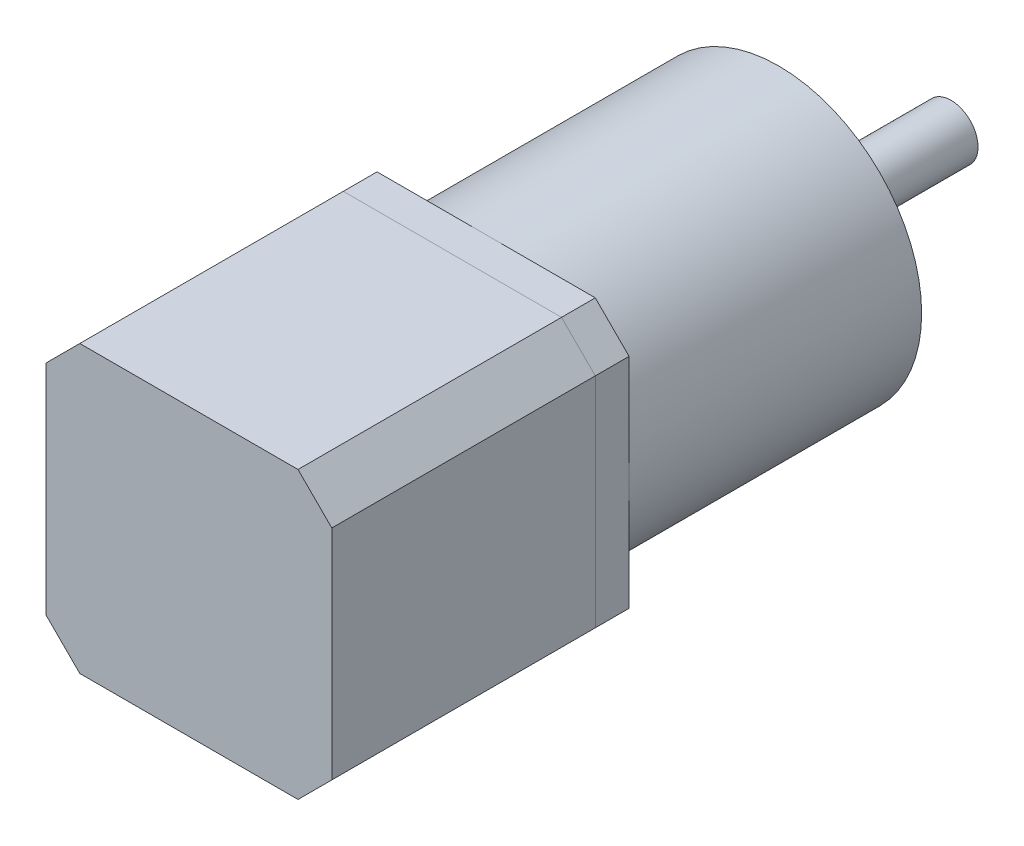
ISO-10303-21;
HEADER;
FILE_DESCRIPTION(('STEP AP214'),'2;1');
FILE_NAME('part.step','',(''),(''),'','','');
FILE_SCHEMA(('AUTOMOTIVE_DESIGN { 1 0 10303 214 1 1 1 1 }'));
ENDSEC;
DATA;
#1=APPLICATION_CONTEXT('core data for automotive mechanical design processes');
#2=APPLICATION_PROTOCOL_DEFINITION('international standard','automotive_design',2000,#1);
#3=PRODUCT_CONTEXT('',#1,'mechanical');
#4=PRODUCT('Part','Part','',(#3));
#5=PRODUCT_RELATED_PRODUCT_CATEGORY('part','',(#4));
#6=PRODUCT_DEFINITION_FORMATION('','',#4);
#7=PRODUCT_DEFINITION_CONTEXT('part definition',#1,'design');
#8=PRODUCT_DEFINITION('design','',#6,#7);
#9=PRODUCT_DEFINITION_SHAPE('','',#8);
#10=(LENGTH_UNIT() NAMED_UNIT(*) SI_UNIT(.MILLI.,.METRE.));
#11=(NAMED_UNIT(*) PLANE_ANGLE_UNIT() SI_UNIT($,.RADIAN.));
#12=(NAMED_UNIT(*) SI_UNIT($,.STERADIAN.) SOLID_ANGLE_UNIT());
#13=UNCERTAINTY_MEASURE_WITH_UNIT(LENGTH_MEASURE(1.E-05),#10,'distance_accuracy_value','');
#14=(GEOMETRIC_REPRESENTATION_CONTEXT(3) GLOBAL_UNCERTAINTY_ASSIGNED_CONTEXT((#13)) GLOBAL_UNIT_ASSIGNED_CONTEXT((#10,
#11,#12)) REPRESENTATION_CONTEXT('',''));
#15=CARTESIAN_POINT('',(0.,0.,0.));
#16=DIRECTION('',(0.,0.,1.));
#17=DIRECTION('',(1.,0.,0.));
#18=AXIS2_PLACEMENT_3D('',#15,#16,#17);
#19=CARTESIAN_POINT('',(0.,0.,-50.8));
#20=DIRECTION('',(0.,0.,1.));
#21=DIRECTION('',(1.,0.,0.));
#22=AXIS2_PLACEMENT_3D('',#19,#20,#21);
#23=CYLINDRICAL_SURFACE('',#22,6.21097509165244);
#24=CARTESIAN_POINT('',(0.,0.,-50.8));
#25=DIRECTION('',(0.,0.,-1.));
#26=DIRECTION('',(-1.,0.,0.));
#27=AXIS2_PLACEMENT_3D('',#24,#25,#26);
#28=CIRCLE('',#27,6.21097509165244);
#29=CARTESIAN_POINT('',(-6.21097509165244,0.,-50.8));
#30=VERTEX_POINT('',#29);
#31=EDGE_CURVE('E11',#30,#30,#28,.T.);
#32=ORIENTED_EDGE('',*,*,#31,.F.);
#33=EDGE_LOOP('',(#32));
#34=FACE_BOUND('',#33,.T.);
#35=CARTESIAN_POINT('',(0.,0.,-50.3));
#36=DIRECTION('',(0.,0.,-1.));
#37=DIRECTION('',(-1.,0.,0.));
#38=AXIS2_PLACEMENT_3D('',#35,#36,#37);
#39=CIRCLE('',#38,6.21097509165244);
#40=CARTESIAN_POINT('',(-6.21097509165244,0.,-50.3));
#41=VERTEX_POINT('',#40);
#42=EDGE_CURVE('E44',#41,#41,#39,.T.);
#43=ORIENTED_EDGE('',*,*,#42,.T.);
#44=EDGE_LOOP('',(#43));
#45=FACE_BOUND('',#44,.T.);
#46=ADVANCED_FACE('F41',(#34,#45),#23,.T.);
#47=CARTESIAN_POINT('',(0.,0.,-50.8));
#48=DIRECTION('',(0.,0.,-1.));
#49=DIRECTION('',(-1.,0.,0.));
#50=AXIS2_PLACEMENT_3D('',#47,#48,#49);
#51=PLANE('',#50);
#52=ORIENTED_EDGE('',*,*,#31,.T.);
#53=EDGE_LOOP('',(#52));
#54=FACE_BOUND('',#53,.T.);
#55=ADVANCED_FACE('F56',(#54),#51,.T.);
#56=CARTESIAN_POINT('',(0.,0.,-50.3));
#57=DIRECTION('',(0.,0.,-1.));
#58=DIRECTION('',(-1.,0.,0.));
#59=AXIS2_PLACEMENT_3D('',#56,#57,#58);
#60=PLANE('',#59);
#61=ORIENTED_EDGE('',*,*,#42,.F.);
#62=EDGE_LOOP('',(#61));
#63=FACE_BOUND('',#62,.T.);
#64=ADVANCED_FACE('F54',(#63),#60,.F.);
#65=CLOSED_SHELL('',(#46,#55,#64));
#66=MANIFOLD_SOLID_BREP('B2',#65);
#67=CARTESIAN_POINT('',(0.,0.,-73.8));
#68=DIRECTION('',(0.,0.,1.));
#69=DIRECTION('',(1.,0.,0.));
#70=AXIS2_PLACEMENT_3D('',#67,#68,#69);
#71=CYLINDRICAL_SURFACE('',#70,4.);
#72=CARTESIAN_POINT('',(0.,0.,-73.8));
#73=DIRECTION('',(0.,0.,-1.));
#74=DIRECTION('',(-1.,0.,0.));
#75=AXIS2_PLACEMENT_3D('',#72,#73,#74);
#76=CIRCLE('',#75,4.);
#77=CARTESIAN_POINT('',(-4.,0.,-73.8));
#78=VERTEX_POINT('',#77);
#79=EDGE_CURVE('E40',#78,#78,#76,.T.);
#80=ORIENTED_EDGE('',*,*,#79,.F.);
#81=EDGE_LOOP('',(#80));
#82=FACE_BOUND('',#81,.T.);
#83=CARTESIAN_POINT('',(0.,0.,-50.3));
#84=DIRECTION('',(0.,0.,-1.));
#85=DIRECTION('',(-1.,0.,0.));
#86=AXIS2_PLACEMENT_3D('',#83,#84,#85);
#87=CIRCLE('',#86,4.);
#88=CARTESIAN_POINT('',(-4.,0.,-50.3));
#89=VERTEX_POINT('',#88);
#90=EDGE_CURVE('E92',#89,#89,#87,.T.);
#91=ORIENTED_EDGE('',*,*,#90,.T.);
#92=EDGE_LOOP('',(#91));
#93=FACE_BOUND('',#92,.T.);
#94=ADVANCED_FACE('F89',(#82,#93),#71,.T.);
#95=CARTESIAN_POINT('',(0.,0.,-73.8));
#96=DIRECTION('',(0.,0.,-1.));
#97=DIRECTION('',(-1.,0.,0.));
#98=AXIS2_PLACEMENT_3D('',#95,#96,#97);
#99=PLANE('',#98);
#100=ORIENTED_EDGE('',*,*,#79,.T.);
#101=EDGE_LOOP('',(#100));
#102=FACE_BOUND('',#101,.T.);
#103=ADVANCED_FACE('F104',(#102),#99,.T.);
#104=CARTESIAN_POINT('',(0.,0.,-50.3));
#105=DIRECTION('',(0.,0.,-1.));
#106=DIRECTION('',(-1.,0.,0.));
#107=AXIS2_PLACEMENT_3D('',#104,#105,#106);
#108=PLANE('',#107);
#109=ORIENTED_EDGE('',*,*,#90,.F.);
#110=EDGE_LOOP('',(#109));
#111=FACE_BOUND('',#110,.T.);
#112=ADVANCED_FACE('F102',(#111),#108,.F.);
#113=CLOSED_SHELL('',(#94,#103,#112));
#114=MANIFOLD_SOLID_BREP('B6',#113);
#115=CARTESIAN_POINT('',(0.,0.,-50.3));
#116=DIRECTION('',(0.,0.,1.));
#117=DIRECTION('',(1.,0.,0.));
#118=AXIS2_PLACEMENT_3D('',#115,#116,#117);
#119=CYLINDRICAL_SURFACE('',#118,11.);
#120=CARTESIAN_POINT('',(0.,0.,-50.3));
#121=DIRECTION('',(0.,0.,-1.));
#122=DIRECTION('',(-1.,0.,0.));
#123=AXIS2_PLACEMENT_3D('',#120,#121,#122);
#124=CIRCLE('',#123,11.);
#125=CARTESIAN_POINT('',(-11.,0.,-50.3));
#126=VERTEX_POINT('',#125);
#127=EDGE_CURVE('E88',#126,#126,#124,.T.);
#128=ORIENTED_EDGE('',*,*,#127,.F.);
#129=EDGE_LOOP('',(#128));
#130=FACE_BOUND('',#129,.T.);
#131=CARTESIAN_POINT('',(0.,0.,-48.3));
#132=DIRECTION('',(0.,0.,-1.));
#133=DIRECTION('',(-1.,0.,0.));
#134=AXIS2_PLACEMENT_3D('',#131,#132,#133);
#135=CIRCLE('',#134,11.);
#136=CARTESIAN_POINT('',(-11.,0.,-48.3));
#137=VERTEX_POINT('',#136);
#138=EDGE_CURVE('E140',#137,#137,#135,.T.);
#139=ORIENTED_EDGE('',*,*,#138,.T.);
#140=EDGE_LOOP('',(#139));
#141=FACE_BOUND('',#140,.T.);
#142=ADVANCED_FACE('F137',(#130,#141),#119,.T.);
#143=CARTESIAN_POINT('',(0.,0.,-50.3));
#144=DIRECTION('',(0.,0.,-1.));
#145=DIRECTION('',(-1.,0.,0.));
#146=AXIS2_PLACEMENT_3D('',#143,#144,#145);
#147=PLANE('',#146);
#148=ORIENTED_EDGE('',*,*,#127,.T.);
#149=EDGE_LOOP('',(#148));
#150=FACE_BOUND('',#149,.T.);
#151=ADVANCED_FACE('F152',(#150),#147,.T.);
#152=CARTESIAN_POINT('',(0.,0.,-48.3));
#153=DIRECTION('',(0.,0.,-1.));
#154=DIRECTION('',(-1.,0.,0.));
#155=AXIS2_PLACEMENT_3D('',#152,#153,#154);
#156=PLANE('',#155);
#157=ORIENTED_EDGE('',*,*,#138,.F.);
#158=EDGE_LOOP('',(#157));
#159=FACE_BOUND('',#158,.T.);
#160=ADVANCED_FACE('F150',(#159),#156,.F.);
#161=CLOSED_SHELL('',(#142,#151,#160));
#162=MANIFOLD_SOLID_BREP('B35',#161);
#163=CARTESIAN_POINT('',(0.,0.,-48.3));
#164=DIRECTION('',(0.,0.,1.));
#165=DIRECTION('',(1.,0.,0.));
#166=AXIS2_PLACEMENT_3D('',#163,#164,#165);
#167=CYLINDRICAL_SURFACE('',#166,21.15);
#168=CARTESIAN_POINT('',(0.,0.,-48.3));
#169=DIRECTION('',(0.,0.,-1.));
#170=DIRECTION('',(-1.,0.,0.));
#171=AXIS2_PLACEMENT_3D('',#168,#169,#170);
#172=CIRCLE('',#171,21.15);
#173=CARTESIAN_POINT('',(-21.15,0.,-48.3));
#174=VERTEX_POINT('',#173);
#175=EDGE_CURVE('E136',#174,#174,#172,.T.);
#176=ORIENTED_EDGE('',*,*,#175,.F.);
#177=EDGE_LOOP('',(#176));
#178=FACE_BOUND('',#177,.T.);
#179=CARTESIAN_POINT('',(0.,0.,-5.));
#180=DIRECTION('',(0.,0.,-1.));
#181=DIRECTION('',(-1.,0.,0.));
#182=AXIS2_PLACEMENT_3D('',#179,#180,#181);
#183=CIRCLE('',#182,21.15);
#184=CARTESIAN_POINT('',(-21.15,0.,-5.));
#185=VERTEX_POINT('',#184);
#186=EDGE_CURVE('E190',#185,#185,#183,.T.);
#187=ORIENTED_EDGE('',*,*,#186,.T.);
#188=EDGE_LOOP('',(#187));
#189=FACE_BOUND('',#188,.T.);
#190=ADVANCED_FACE('F187',(#178,#189),#167,.T.);
#191=CARTESIAN_POINT('',(0.,0.,-48.3));
#192=DIRECTION('',(0.,0.,-1.));
#193=DIRECTION('',(-1.,0.,0.));
#194=AXIS2_PLACEMENT_3D('',#191,#192,#193);
#195=PLANE('',#194);
#196=CARTESIAN_POINT('',(-17.5000000000005,4.95236783133562E-13,-48.3));
#197=DIRECTION('',(0.,0.,-1.));
#198=DIRECTION('',(-1.,0.,0.));
#199=AXIS2_PLACEMENT_3D('',#196,#197,#198);
#200=CIRCLE('',#199,1.14415066271215);
#201=CARTESIAN_POINT('',(-18.6441506627126,4.95236783133562E-13,-48.3));
#202=VERTEX_POINT('',#201);
#203=EDGE_CURVE('E217',#202,#202,#200,.T.);
#204=ORIENTED_EDGE('',*,*,#203,.F.);
#205=EDGE_LOOP('',(#204));
#206=FACE_BOUND('',#205,.T.);
#207=CARTESIAN_POINT('',(-9.90473566267125E-13,-17.5,-48.3));
#208=DIRECTION('',(0.,0.,-1.));
#209=DIRECTION('',(-1.,0.,0.));
#210=AXIS2_PLACEMENT_3D('',#207,#208,#209);
#211=CIRCLE('',#210,1.14415066271282);
#212=CARTESIAN_POINT('',(-1.14415066271381,-17.5,-48.3));
#213=VERTEX_POINT('',#212);
#214=EDGE_CURVE('E211',#213,#213,#211,.T.);
#215=ORIENTED_EDGE('',*,*,#214,.F.);
#216=EDGE_LOOP('',(#215));
#217=FACE_BOUND('',#216,.T.);
#218=CARTESIAN_POINT('',(17.4999999999995,-4.9737991503207E-13,-48.3));
#219=DIRECTION('',(0.,0.,-1.));
#220=DIRECTION('',(-1.,0.,0.));
#221=AXIS2_PLACEMENT_3D('',#218,#219,#220);
#222=CIRCLE('',#221,1.14415066271255);
#223=CARTESIAN_POINT('',(16.355849337287,-4.9737991503207E-13,-48.3));
#224=VERTEX_POINT('',#223);
#225=EDGE_CURVE('E205',#224,#224,#222,.T.);
#226=ORIENTED_EDGE('',*,*,#225,.F.);
#227=EDGE_LOOP('',(#226));
#228=FACE_BOUND('',#227,.T.);
#229=CARTESIAN_POINT('',(0.,17.5,-48.3));
#230=DIRECTION('',(0.,0.,-1.));
#231=DIRECTION('',(-1.,0.,0.));
#232=AXIS2_PLACEMENT_3D('',#229,#230,#231);
#233=CIRCLE('',#232,1.14415066271176);
#234=CARTESIAN_POINT('',(-1.14415066271176,17.5,-48.3));
#235=VERTEX_POINT('',#234);
#236=EDGE_CURVE('E199',#235,#235,#233,.T.);
#237=ORIENTED_EDGE('',*,*,#236,.F.);
#238=EDGE_LOOP('',(#237));
#239=FACE_BOUND('',#238,.T.);
#240=ORIENTED_EDGE('',*,*,#175,.T.);
#241=EDGE_LOOP('',(#240));
#242=FACE_BOUND('',#241,.T.);
#243=ADVANCED_FACE('F232',(#206,#217,#228,#239,#242),#195,.T.);
#244=CARTESIAN_POINT('',(0.,0.,-5.));
#245=DIRECTION('',(0.,0.,-1.));
#246=DIRECTION('',(-1.,0.,0.));
#247=AXIS2_PLACEMENT_3D('',#244,#245,#246);
#248=PLANE('',#247);
#249=ORIENTED_EDGE('',*,*,#186,.F.);
#250=EDGE_LOOP('',(#249));
#251=FACE_BOUND('',#250,.T.);
#252=ADVANCED_FACE('F235',(#251),#248,.F.);
#253=CARTESIAN_POINT('',(0.,17.5,-38.3));
#254=DIRECTION('',(0.,0.,-1.));
#255=DIRECTION('',(-1.,0.,0.));
#256=AXIS2_PLACEMENT_3D('',#253,#254,#255);
#257=CYLINDRICAL_SURFACE('',#256,1.14415066271176);
#258=CARTESIAN_POINT('',(0.,17.5,-38.3));
#259=DIRECTION('',(0.,0.,-1.));
#260=DIRECTION('',(-1.,0.,0.));
#261=AXIS2_PLACEMENT_3D('',#258,#259,#260);
#262=CIRCLE('',#261,1.14415066271176);
#263=CARTESIAN_POINT('',(-1.14415066271176,17.5,-38.3));
#264=VERTEX_POINT('',#263);
#265=EDGE_CURVE('E197',#264,#264,#262,.T.);
#266=ORIENTED_EDGE('',*,*,#265,.F.);
#267=EDGE_LOOP('',(#266));
#268=FACE_BOUND('',#267,.T.);
#269=ORIENTED_EDGE('',*,*,#236,.T.);
#270=EDGE_LOOP('',(#269));
#271=FACE_BOUND('',#270,.T.);
#272=ADVANCED_FACE('F243',(#268,#271),#257,.F.);
#273=CARTESIAN_POINT('',(0.,17.5,-38.3));
#274=DIRECTION('',(0.,0.,-1.));
#275=DIRECTION('',(-1.,0.,0.));
#276=AXIS2_PLACEMENT_3D('',#273,#274,#275);
#277=PLANE('',#276);
#278=ORIENTED_EDGE('',*,*,#265,.T.);
#279=EDGE_LOOP('',(#278));
#280=FACE_BOUND('',#279,.T.);
#281=ADVANCED_FACE('F245',(#280),#277,.T.);
#282=CARTESIAN_POINT('',(17.4999999999995,-4.9737991503207E-13,-38.3));
#283=DIRECTION('',(0.,0.,-1.));
#284=DIRECTION('',(-1.,0.,0.));
#285=AXIS2_PLACEMENT_3D('',#282,#283,#284);
#286=CYLINDRICAL_SURFACE('',#285,1.14415066271255);
#287=CARTESIAN_POINT('',(17.4999999999995,-4.9737991503207E-13,-38.3));
#288=DIRECTION('',(0.,0.,-1.));
#289=DIRECTION('',(-1.,0.,0.));
#290=AXIS2_PLACEMENT_3D('',#287,#288,#289);
#291=CIRCLE('',#290,1.14415066271255);
#292=CARTESIAN_POINT('',(16.355849337287,-4.9737991503207E-13,-38.3));
#293=VERTEX_POINT('',#292);
#294=EDGE_CURVE('E208',#293,#293,#291,.T.);
#295=ORIENTED_EDGE('',*,*,#294,.F.);
#296=EDGE_LOOP('',(#295));
#297=FACE_BOUND('',#296,.T.);
#298=ORIENTED_EDGE('',*,*,#225,.T.);
#299=EDGE_LOOP('',(#298));
#300=FACE_BOUND('',#299,.T.);
#301=ADVANCED_FACE('F252',(#297,#300),#286,.F.);
#302=CARTESIAN_POINT('',(17.4999999999995,-4.9737991503207E-13,-38.3));
#303=DIRECTION('',(0.,0.,-1.));
#304=DIRECTION('',(-1.,0.,0.));
#305=AXIS2_PLACEMENT_3D('',#302,#303,#304);
#306=PLANE('',#305);
#307=ORIENTED_EDGE('',*,*,#294,.T.);
#308=EDGE_LOOP('',(#307));
#309=FACE_BOUND('',#308,.T.);
#310=ADVANCED_FACE('F292',(#309),#306,.T.);
#311=CARTESIAN_POINT('',(-9.90473566267125E-13,-17.5,-38.3));
#312=DIRECTION('',(0.,0.,-1.));
#313=DIRECTION('',(-1.,0.,0.));
#314=AXIS2_PLACEMENT_3D('',#311,#312,#313);
#315=CYLINDRICAL_SURFACE('',#314,1.14415066271282);
#316=CARTESIAN_POINT('',(-9.90473566267125E-13,-17.5,-38.3));
#317=DIRECTION('',(0.,0.,-1.));
#318=DIRECTION('',(-1.,0.,0.));
#319=AXIS2_PLACEMENT_3D('',#316,#317,#318);
#320=CIRCLE('',#319,1.14415066271282);
#321=CARTESIAN_POINT('',(-1.14415066271381,-17.5,-38.3));
#322=VERTEX_POINT('',#321);
#323=EDGE_CURVE('E214',#322,#322,#320,.T.);
#324=ORIENTED_EDGE('',*,*,#323,.F.);
#325=EDGE_LOOP('',(#324));
#326=FACE_BOUND('',#325,.T.);
#327=ORIENTED_EDGE('',*,*,#214,.T.);
#328=EDGE_LOOP('',(#327));
#329=FACE_BOUND('',#328,.T.);
#330=ADVANCED_FACE('F301',(#326,#329),#315,.F.);
#331=CARTESIAN_POINT('',(-9.90473566267125E-13,-17.5,-38.3));
#332=DIRECTION('',(0.,0.,-1.));
#333=DIRECTION('',(-1.,0.,0.));
#334=AXIS2_PLACEMENT_3D('',#331,#332,#333);
#335=PLANE('',#334);
#336=ORIENTED_EDGE('',*,*,#323,.T.);
#337=EDGE_LOOP('',(#336));
#338=FACE_BOUND('',#337,.T.);
#339=ADVANCED_FACE('F228',(#338),#335,.T.);
#340=CARTESIAN_POINT('',(-17.5000000000005,4.95236783133562E-13,-38.3));
#341=DIRECTION('',(0.,0.,-1.));
#342=DIRECTION('',(-1.,0.,0.));
#343=AXIS2_PLACEMENT_3D('',#340,#341,#342);
#344=CYLINDRICAL_SURFACE('',#343,1.14415066271215);
#345=CARTESIAN_POINT('',(-17.5000000000005,4.95236783133562E-13,-38.3));
#346=DIRECTION('',(0.,0.,-1.));
#347=DIRECTION('',(-1.,0.,0.));
#348=AXIS2_PLACEMENT_3D('',#345,#346,#347);
#349=CIRCLE('',#348,1.14415066271215);
#350=CARTESIAN_POINT('',(-18.6441506627126,4.95236783133562E-13,-38.3));
#351=VERTEX_POINT('',#350);
#352=EDGE_CURVE('E202',#351,#351,#349,.T.);
#353=ORIENTED_EDGE('',*,*,#352,.F.);
#354=EDGE_LOOP('',(#353));
#355=FACE_BOUND('',#354,.T.);
#356=ORIENTED_EDGE('',*,*,#203,.T.);
#357=EDGE_LOOP('',(#356));
#358=FACE_BOUND('',#357,.T.);
#359=ADVANCED_FACE('F225',(#355,#358),#344,.F.);
#360=CARTESIAN_POINT('',(-17.5000000000005,4.95236783133562E-13,-38.3));
#361=DIRECTION('',(0.,0.,-1.));
#362=DIRECTION('',(-1.,0.,0.));
#363=AXIS2_PLACEMENT_3D('',#360,#361,#362);
#364=PLANE('',#363);
#365=ORIENTED_EDGE('',*,*,#352,.T.);
#366=EDGE_LOOP('',(#365));
#367=FACE_BOUND('',#366,.T.);
#368=ADVANCED_FACE('F223',(#367),#364,.T.);
#369=CLOSED_SHELL('',(#190,#243,#252,#272,#281,#301,#310,#330,#339,#359,#368));
#370=MANIFOLD_SOLID_BREP('B83',#369);
#371=CARTESIAN_POINT('',(-21.15,-21.15,-5.));
#372=DIRECTION('',(1.,0.,0.));
#373=DIRECTION('',(0.,0.,-1.));
#374=AXIS2_PLACEMENT_3D('',#371,#372,#373);
#375=PLANE('',#374);
#376=DIRECTION('',(0.,1.,0.));
#377=VECTOR('',#376,1.);
#378=CARTESIAN_POINT('',(-21.15,-21.15,-5.));
#379=LINE('',#378,#377);
#380=CARTESIAN_POINT('',(-21.15,-16.15,-5.));
#381=VERTEX_POINT('',#380);
#382=CARTESIAN_POINT('',(-21.15,16.15,-5.));
#383=VERTEX_POINT('',#382);
#384=EDGE_CURVE('E447',#381,#383,#379,.T.);
#385=ORIENTED_EDGE('',*,*,#384,.F.);
#386=DIRECTION('',(0.,0.,1.));
#387=VECTOR('',#386,1.);
#388=CARTESIAN_POINT('',(-21.15,-16.15,-5.));
#389=LINE('',#388,#387);
#390=CARTESIAN_POINT('',(-21.15,-16.15,0.));
#391=VERTEX_POINT('',#390);
#392=EDGE_CURVE('E473',#381,#391,#389,.T.);
#393=ORIENTED_EDGE('',*,*,#392,.T.);
#394=DIRECTION('',(0.,1.,0.));
#395=VECTOR('',#394,1.);
#396=CARTESIAN_POINT('',(-21.15,-21.15,0.));
#397=LINE('',#396,#395);
#398=CARTESIAN_POINT('',(-21.15,16.15,0.));
#399=VERTEX_POINT('',#398);
#400=EDGE_CURVE('E481',#391,#399,#397,.T.);
#401=ORIENTED_EDGE('',*,*,#400,.T.);
#402=DIRECTION('',(0.,0.,-1.));
#403=VECTOR('',#402,1.);
#404=CARTESIAN_POINT('',(-21.15,16.15,-5.));
#405=LINE('',#404,#403);
#406=EDGE_CURVE('E471',#399,#383,#405,.T.);
#407=ORIENTED_EDGE('',*,*,#406,.T.);
#408=EDGE_LOOP('',(#385,#393,#401,#407));
#409=FACE_BOUND('',#408,.T.);
#410=ADVANCED_FACE('F356',(#409),#375,.F.);
#411=CARTESIAN_POINT('',(21.15,21.15,-5.));
#412=DIRECTION('',(0.,-1.,0.));
#413=DIRECTION('',(0.,0.,-1.));
#414=AXIS2_PLACEMENT_3D('',#411,#412,#413);
#415=PLANE('',#414);
#416=DIRECTION('',(1.,0.,0.));
#417=VECTOR('',#416,1.);
#418=CARTESIAN_POINT('',(21.15,21.15,0.));
#419=LINE('',#418,#417);
#420=CARTESIAN_POINT('',(-16.15,21.15,0.));
#421=VERTEX_POINT('',#420);
#422=CARTESIAN_POINT('',(16.15,21.15,0.));
#423=VERTEX_POINT('',#422);
#424=EDGE_CURVE('E452',#421,#423,#419,.T.);
#425=ORIENTED_EDGE('',*,*,#424,.T.);
#426=DIRECTION('',(0.,0.,-1.));
#427=VECTOR('',#426,1.);
#428=CARTESIAN_POINT('',(16.15,21.15,-5.));
#429=LINE('',#428,#427);
#430=CARTESIAN_POINT('',(16.15,21.15,-5.));
#431=VERTEX_POINT('',#430);
#432=EDGE_CURVE('E185',#423,#431,#429,.T.);
#433=ORIENTED_EDGE('',*,*,#432,.T.);
#434=DIRECTION('',(1.,0.,0.));
#435=VECTOR('',#434,1.);
#436=CARTESIAN_POINT('',(21.15,21.15,-5.));
#437=LINE('',#436,#435);
#438=CARTESIAN_POINT('',(-16.15,21.15,-5.));
#439=VERTEX_POINT('',#438);
#440=EDGE_CURVE('E450',#439,#431,#437,.T.);
#441=ORIENTED_EDGE('',*,*,#440,.F.);
#442=DIRECTION('',(0.,0.,1.));
#443=VECTOR('',#442,1.);
#444=CARTESIAN_POINT('',(-16.15,21.15,-5.));
#445=LINE('',#444,#443);
#446=EDGE_CURVE('E364',#439,#421,#445,.T.);
#447=ORIENTED_EDGE('',*,*,#446,.T.);
#448=EDGE_LOOP('',(#425,#433,#441,#447));
#449=FACE_BOUND('',#448,.T.);
#450=ADVANCED_FACE('F478',(#449),#415,.F.);
#451=CARTESIAN_POINT('',(21.15,-21.15,-5.));
#452=DIRECTION('',(-1.,0.,0.));
#453=DIRECTION('',(0.,0.,1.));
#454=AXIS2_PLACEMENT_3D('',#451,#452,#453);
#455=PLANE('',#454);
#456=DIRECTION('',(0.,-1.,0.));
#457=VECTOR('',#456,1.);
#458=CARTESIAN_POINT('',(21.15,-21.15,0.));
#459=LINE('',#458,#457);
#460=CARTESIAN_POINT('',(21.15,16.15,0.));
#461=VERTEX_POINT('',#460);
#462=CARTESIAN_POINT('',(21.15,-16.15,0.));
#463=VERTEX_POINT('',#462);
#464=EDGE_CURVE('E448',#461,#463,#459,.T.);
#465=ORIENTED_EDGE('',*,*,#464,.T.);
#466=DIRECTION('',(0.,0.,-1.));
#467=VECTOR('',#466,1.);
#468=CARTESIAN_POINT('',(21.15,-16.15,-5.));
#469=LINE('',#468,#467);
#470=CARTESIAN_POINT('',(21.15,-16.15,-5.));
#471=VERTEX_POINT('',#470);
#472=EDGE_CURVE('E426',#463,#471,#469,.T.);
#473=ORIENTED_EDGE('',*,*,#472,.T.);
#474=DIRECTION('',(0.,-1.,0.));
#475=VECTOR('',#474,1.);
#476=CARTESIAN_POINT('',(21.15,-21.15,-5.));
#477=LINE('',#476,#475);
#478=CARTESIAN_POINT('',(21.15,16.15,-5.));
#479=VERTEX_POINT('',#478);
#480=EDGE_CURVE('E485',#479,#471,#477,.T.);
#481=ORIENTED_EDGE('',*,*,#480,.F.);
#482=DIRECTION('',(0.,0.,1.));
#483=VECTOR('',#482,1.);
#484=CARTESIAN_POINT('',(21.15,16.15,-5.));
#485=LINE('',#484,#483);
#486=EDGE_CURVE('E431',#479,#461,#485,.T.);
#487=ORIENTED_EDGE('',*,*,#486,.T.);
#488=EDGE_LOOP('',(#465,#473,#481,#487));
#489=FACE_BOUND('',#488,.T.);
#490=ADVANCED_FACE('F495',(#489),#455,.F.);
#491=CARTESIAN_POINT('',(21.15,-21.15,-5.));
#492=DIRECTION('',(0.,1.,0.));
#493=DIRECTION('',(0.,0.,1.));
#494=AXIS2_PLACEMENT_3D('',#491,#492,#493);
#495=PLANE('',#494);
#496=DIRECTION('',(-1.,0.,0.));
#497=VECTOR('',#496,1.);
#498=CARTESIAN_POINT('',(21.15,-21.15,-5.));
#499=LINE('',#498,#497);
#500=CARTESIAN_POINT('',(16.15,-21.15,-5.));
#501=VERTEX_POINT('',#500);
#502=CARTESIAN_POINT('',(-16.15,-21.15,-5.));
#503=VERTEX_POINT('',#502);
#504=EDGE_CURVE('E441',#501,#503,#499,.T.);
#505=ORIENTED_EDGE('',*,*,#504,.F.);
#506=DIRECTION('',(0.,0.,1.));
#507=VECTOR('',#506,1.);
#508=CARTESIAN_POINT('',(16.15,-21.15,-5.));
#509=LINE('',#508,#507);
#510=CARTESIAN_POINT('',(16.15,-21.15,0.));
#511=VERTEX_POINT('',#510);
#512=EDGE_CURVE('E425',#501,#511,#509,.T.);
#513=ORIENTED_EDGE('',*,*,#512,.T.);
#514=DIRECTION('',(-1.,0.,0.));
#515=VECTOR('',#514,1.);
#516=CARTESIAN_POINT('',(21.15,-21.15,0.));
#517=LINE('',#516,#515);
#518=CARTESIAN_POINT('',(-16.15,-21.15,0.));
#519=VERTEX_POINT('',#518);
#520=EDGE_CURVE('E438',#511,#519,#517,.T.);
#521=ORIENTED_EDGE('',*,*,#520,.T.);
#522=DIRECTION('',(0.,0.,-1.));
#523=VECTOR('',#522,1.);
#524=CARTESIAN_POINT('',(-16.15,-21.15,-5.));
#525=LINE('',#524,#523);
#526=EDGE_CURVE('E443',#519,#503,#525,.T.);
#527=ORIENTED_EDGE('',*,*,#526,.T.);
#528=EDGE_LOOP('',(#505,#513,#521,#527));
#529=FACE_BOUND('',#528,.T.);
#530=ADVANCED_FACE('F437',(#529),#495,.F.);
#531=CARTESIAN_POINT('',(0.,0.,-5.));
#532=DIRECTION('',(0.,0.,1.));
#533=DIRECTION('',(1.,0.,0.));
#534=AXIS2_PLACEMENT_3D('',#531,#532,#533);
#535=PLANE('',#534);
#536=ORIENTED_EDGE('',*,*,#480,.T.);
#537=DIRECTION('',(0.707106781186546,0.707106781186549,0.));
#538=VECTOR('',#537,1.);
#539=CARTESIAN_POINT('',(16.15,-21.15,-5.));
#540=LINE('',#539,#538);
#541=EDGE_CURVE('E469',#471,#501,#540,.F.);
#542=ORIENTED_EDGE('',*,*,#541,.T.);
#543=ORIENTED_EDGE('',*,*,#504,.T.);
#544=DIRECTION('',(0.707106781186549,-0.707106781186546,0.));
#545=VECTOR('',#544,1.);
#546=CARTESIAN_POINT('',(-21.15,-16.15,-5.));
#547=LINE('',#546,#545);
#548=EDGE_CURVE('E467',#503,#381,#547,.F.);
#549=ORIENTED_EDGE('',*,*,#548,.T.);
#550=ORIENTED_EDGE('',*,*,#384,.T.);
#551=DIRECTION('',(-0.707106781186546,-0.707106781186549,0.));
#552=VECTOR('',#551,1.);
#553=CARTESIAN_POINT('',(-16.15,21.15,-5.));
#554=LINE('',#553,#552);
#555=EDGE_CURVE('E376',#383,#439,#554,.F.);
#556=ORIENTED_EDGE('',*,*,#555,.T.);
#557=ORIENTED_EDGE('',*,*,#440,.T.);
#558=DIRECTION('',(-0.707106781186549,0.707106781186546,0.));
#559=VECTOR('',#558,1.);
#560=CARTESIAN_POINT('',(21.15,16.15,-5.));
#561=LINE('',#560,#559);
#562=EDGE_CURVE('E465',#431,#479,#561,.F.);
#563=ORIENTED_EDGE('',*,*,#562,.T.);
#564=EDGE_LOOP('',(#536,#542,#543,#549,#550,#556,#557,#563));
#565=FACE_BOUND('',#564,.T.);
#566=ADVANCED_FACE('F489',(#565),#535,.F.);
#567=CARTESIAN_POINT('',(0.,0.,0.));
#568=DIRECTION('',(0.,0.,1.));
#569=DIRECTION('',(1.,0.,0.));
#570=AXIS2_PLACEMENT_3D('',#567,#568,#569);
#571=PLANE('',#570);
#572=ORIENTED_EDGE('',*,*,#520,.F.);
#573=DIRECTION('',(-0.707106781186546,-0.707106781186549,0.));
#574=VECTOR('',#573,1.);
#575=CARTESIAN_POINT('',(18.65,-18.6499999999999,0.));
#576=LINE('',#575,#574);
#577=EDGE_CURVE('E421',#511,#463,#576,.F.);
#578=ORIENTED_EDGE('',*,*,#577,.T.);
#579=ORIENTED_EDGE('',*,*,#464,.F.);
#580=DIRECTION('',(0.707106781186549,-0.707106781186546,0.));
#581=VECTOR('',#580,1.);
#582=CARTESIAN_POINT('',(18.6499999999999,18.65,0.));
#583=LINE('',#582,#581);
#584=EDGE_CURVE('E458',#461,#423,#583,.F.);
#585=ORIENTED_EDGE('',*,*,#584,.T.);
#586=ORIENTED_EDGE('',*,*,#424,.F.);
#587=DIRECTION('',(0.707106781186546,0.707106781186549,0.));
#588=VECTOR('',#587,1.);
#589=CARTESIAN_POINT('',(-18.65,18.65,0.));
#590=LINE('',#589,#588);
#591=EDGE_CURVE('E442',#421,#399,#590,.F.);
#592=ORIENTED_EDGE('',*,*,#591,.T.);
#593=ORIENTED_EDGE('',*,*,#400,.F.);
#594=DIRECTION('',(-0.707106781186549,0.707106781186546,0.));
#595=VECTOR('',#594,1.);
#596=CARTESIAN_POINT('',(-18.65,-18.65,0.));
#597=LINE('',#596,#595);
#598=EDGE_CURVE('E432',#391,#519,#597,.F.);
#599=ORIENTED_EDGE('',*,*,#598,.T.);
#600=EDGE_LOOP('',(#572,#578,#579,#585,#586,#592,#593,#599));
#601=FACE_BOUND('',#600,.T.);
#602=ADVANCED_FACE('F445',(#601),#571,.T.);
#603=CARTESIAN_POINT('',(16.15,-21.15,-5.));
#604=DIRECTION('',(-0.707106781186549,0.707106781186546,0.));
#605=DIRECTION('',(0.,0.,1.));
#606=AXIS2_PLACEMENT_3D('',#603,#604,#605);
#607=PLANE('',#606);
#608=ORIENTED_EDGE('',*,*,#541,.F.);
#609=ORIENTED_EDGE('',*,*,#472,.F.);
#610=ORIENTED_EDGE('',*,*,#577,.F.);
#611=ORIENTED_EDGE('',*,*,#512,.F.);
#612=EDGE_LOOP('',(#608,#609,#610,#611));
#613=FACE_BOUND('',#612,.T.);
#614=ADVANCED_FACE('F424',(#613),#607,.F.);
#615=CARTESIAN_POINT('',(-21.15,-16.15,-5.));
#616=DIRECTION('',(0.707106781186546,0.707106781186549,0.));
#617=DIRECTION('',(0.,0.,1.));
#618=AXIS2_PLACEMENT_3D('',#615,#616,#617);
#619=PLANE('',#618);
#620=ORIENTED_EDGE('',*,*,#548,.F.);
#621=ORIENTED_EDGE('',*,*,#526,.F.);
#622=ORIENTED_EDGE('',*,*,#598,.F.);
#623=ORIENTED_EDGE('',*,*,#392,.F.);
#624=EDGE_LOOP('',(#620,#621,#622,#623));
#625=FACE_BOUND('',#624,.T.);
#626=ADVANCED_FACE('F500',(#625),#619,.F.);
#627=CARTESIAN_POINT('',(21.15,16.15,-5.));
#628=DIRECTION('',(-0.707106781186546,-0.707106781186549,0.));
#629=DIRECTION('',(0.,0.,1.));
#630=AXIS2_PLACEMENT_3D('',#627,#628,#629);
#631=PLANE('',#630);
#632=ORIENTED_EDGE('',*,*,#562,.F.);
#633=ORIENTED_EDGE('',*,*,#432,.F.);
#634=ORIENTED_EDGE('',*,*,#584,.F.);
#635=ORIENTED_EDGE('',*,*,#486,.F.);
#636=EDGE_LOOP('',(#632,#633,#634,#635));
#637=FACE_BOUND('',#636,.T.);
#638=ADVANCED_FACE('F493',(#637),#631,.F.);
#639=CARTESIAN_POINT('',(-16.15,21.15,-5.));
#640=DIRECTION('',(0.707106781186549,-0.707106781186546,0.));
#641=DIRECTION('',(0.,0.,1.));
#642=AXIS2_PLACEMENT_3D('',#639,#640,#641);
#643=PLANE('',#642);
#644=ORIENTED_EDGE('',*,*,#555,.F.);
#645=ORIENTED_EDGE('',*,*,#406,.F.);
#646=ORIENTED_EDGE('',*,*,#591,.F.);
#647=ORIENTED_EDGE('',*,*,#446,.F.);
#648=EDGE_LOOP('',(#644,#645,#646,#647));
#649=FACE_BOUND('',#648,.T.);
#650=ADVANCED_FACE('F358',(#649),#643,.F.);
#651=CLOSED_SHELL('',(#410,#450,#490,#530,#566,#602,#614,#626,#638,#650));
#652=MANIFOLD_SOLID_BREP('B131',#651);
#653=CARTESIAN_POINT('',(21.15,21.15,39.));
#654=DIRECTION('',(-1.,0.,0.));
#655=DIRECTION('',(0.,-1.,0.));
#656=AXIS2_PLACEMENT_3D('',#653,#654,#655);
#657=PLANE('',#656);
#658=DIRECTION('',(0.,1.,0.));
#659=VECTOR('',#658,1.);
#660=CARTESIAN_POINT('',(21.15,21.15,39.));
#661=LINE('',#660,#659);
#662=CARTESIAN_POINT('',(21.15,-16.15,39.));
#663=VERTEX_POINT('',#662);
#664=CARTESIAN_POINT('',(21.15,16.15,39.));
#665=VERTEX_POINT('',#664);
#666=EDGE_CURVE('E674',#663,#665,#661,.T.);
#667=ORIENTED_EDGE('',*,*,#666,.F.);
#668=DIRECTION('',(0.,0.,-1.));
#669=VECTOR('',#668,1.);
#670=CARTESIAN_POINT('',(21.15,-16.15,39.));
#671=LINE('',#670,#669);
#672=CARTESIAN_POINT('',(21.15,-16.15,0.));
#673=VERTEX_POINT('',#672);
#674=EDGE_CURVE('E700',#663,#673,#671,.T.);
#675=ORIENTED_EDGE('',*,*,#674,.T.);
#676=DIRECTION('',(0.,1.,0.));
#677=VECTOR('',#676,1.);
#678=CARTESIAN_POINT('',(21.15,21.15,0.));
#679=LINE('',#678,#677);
#680=CARTESIAN_POINT('',(21.15,16.15,0.));
#681=VERTEX_POINT('',#680);
#682=EDGE_CURVE('E708',#673,#681,#679,.T.);
#683=ORIENTED_EDGE('',*,*,#682,.T.);
#684=DIRECTION('',(0.,0.,1.));
#685=VECTOR('',#684,1.);
#686=CARTESIAN_POINT('',(21.15,16.15,39.));
#687=LINE('',#686,#685);
#688=EDGE_CURVE('E698',#681,#665,#687,.T.);
#689=ORIENTED_EDGE('',*,*,#688,.T.);
#690=EDGE_LOOP('',(#667,#675,#683,#689));
#691=FACE_BOUND('',#690,.T.);
#692=ADVANCED_FACE('F583',(#691),#657,.F.);
#693=CARTESIAN_POINT('',(-21.15,21.15,39.));
#694=DIRECTION('',(0.,-1.,0.));
#695=DIRECTION('',(0.,0.,-1.));
#696=AXIS2_PLACEMENT_3D('',#693,#694,#695);
#697=PLANE('',#696);
#698=DIRECTION('',(-1.,0.,0.));
#699=VECTOR('',#698,1.);
#700=CARTESIAN_POINT('',(-21.15,21.15,0.));
#701=LINE('',#700,#699);
#702=CARTESIAN_POINT('',(16.15,21.15,0.));
#703=VERTEX_POINT('',#702);
#704=CARTESIAN_POINT('',(-16.15,21.15,0.));
#705=VERTEX_POINT('',#704);
#706=EDGE_CURVE('E679',#703,#705,#701,.T.);
#707=ORIENTED_EDGE('',*,*,#706,.T.);
#708=DIRECTION('',(0.,0.,1.));
#709=VECTOR('',#708,1.);
#710=CARTESIAN_POINT('',(-16.15,21.15,39.));
#711=LINE('',#710,#709);
#712=CARTESIAN_POINT('',(-16.15,21.15,39.));
#713=VERTEX_POINT('',#712);
#714=EDGE_CURVE('E354',#705,#713,#711,.T.);
#715=ORIENTED_EDGE('',*,*,#714,.T.);
#716=DIRECTION('',(-1.,0.,0.));
#717=VECTOR('',#716,1.);
#718=CARTESIAN_POINT('',(-21.15,21.15,39.));
#719=LINE('',#718,#717);
#720=CARTESIAN_POINT('',(16.15,21.15,39.));
#721=VERTEX_POINT('',#720);
#722=EDGE_CURVE('E677',#721,#713,#719,.T.);
#723=ORIENTED_EDGE('',*,*,#722,.F.);
#724=DIRECTION('',(0.,0.,-1.));
#725=VECTOR('',#724,1.);
#726=CARTESIAN_POINT('',(16.15,21.15,39.));
#727=LINE('',#726,#725);
#728=EDGE_CURVE('E591',#721,#703,#727,.T.);
#729=ORIENTED_EDGE('',*,*,#728,.T.);
#730=EDGE_LOOP('',(#707,#715,#723,#729));
#731=FACE_BOUND('',#730,.T.);
#732=ADVANCED_FACE('F705',(#731),#697,.F.);
#733=CARTESIAN_POINT('',(-21.15,21.15,39.));
#734=DIRECTION('',(1.,0.,0.));
#735=DIRECTION('',(0.,1.,0.));
#736=AXIS2_PLACEMENT_3D('',#733,#734,#735);
#737=PLANE('',#736);
#738=DIRECTION('',(0.,-1.,0.));
#739=VECTOR('',#738,1.);
#740=CARTESIAN_POINT('',(-21.15,21.15,0.));
#741=LINE('',#740,#739);
#742=CARTESIAN_POINT('',(-21.15,16.15,0.));
#743=VERTEX_POINT('',#742);
#744=CARTESIAN_POINT('',(-21.15,-16.15,0.));
#745=VERTEX_POINT('',#744);
#746=EDGE_CURVE('E675',#743,#745,#741,.T.);
#747=ORIENTED_EDGE('',*,*,#746,.T.);
#748=DIRECTION('',(0.,0.,1.));
#749=VECTOR('',#748,1.);
#750=CARTESIAN_POINT('',(-21.15,-16.15,39.));
#751=LINE('',#750,#749);
#752=CARTESIAN_POINT('',(-21.15,-16.15,39.));
#753=VERTEX_POINT('',#752);
#754=EDGE_CURVE('E653',#745,#753,#751,.T.);
#755=ORIENTED_EDGE('',*,*,#754,.T.);
#756=DIRECTION('',(0.,-1.,0.));
#757=VECTOR('',#756,1.);
#758=CARTESIAN_POINT('',(-21.15,21.15,39.));
#759=LINE('',#758,#757);
#760=CARTESIAN_POINT('',(-21.15,16.15,39.));
#761=VERTEX_POINT('',#760);
#762=EDGE_CURVE('E712',#761,#753,#759,.T.);
#763=ORIENTED_EDGE('',*,*,#762,.F.);
#764=DIRECTION('',(0.,0.,-1.));
#765=VECTOR('',#764,1.);
#766=CARTESIAN_POINT('',(-21.15,16.15,39.));
#767=LINE('',#766,#765);
#768=EDGE_CURVE('E658',#761,#743,#767,.T.);
#769=ORIENTED_EDGE('',*,*,#768,.T.);
#770=EDGE_LOOP('',(#747,#755,#763,#769));
#771=FACE_BOUND('',#770,.T.);
#772=ADVANCED_FACE('F722',(#771),#737,.F.);
#773=CARTESIAN_POINT('',(-21.15,-21.15,39.));
#774=DIRECTION('',(0.,1.,0.));
#775=DIRECTION('',(0.,0.,1.));
#776=AXIS2_PLACEMENT_3D('',#773,#774,#775);
#777=PLANE('',#776);
#778=DIRECTION('',(1.,0.,0.));
#779=VECTOR('',#778,1.);
#780=CARTESIAN_POINT('',(-21.15,-21.15,39.));
#781=LINE('',#780,#779);
#782=CARTESIAN_POINT('',(-16.15,-21.15,39.));
#783=VERTEX_POINT('',#782);
#784=CARTESIAN_POINT('',(16.15,-21.15,39.));
#785=VERTEX_POINT('',#784);
#786=EDGE_CURVE('E668',#783,#785,#781,.T.);
#787=ORIENTED_EDGE('',*,*,#786,.F.);
#788=DIRECTION('',(0.,0.,-1.));
#789=VECTOR('',#788,1.);
#790=CARTESIAN_POINT('',(-16.15,-21.15,39.));
#791=LINE('',#790,#789);
#792=CARTESIAN_POINT('',(-16.15,-21.15,0.));
#793=VERTEX_POINT('',#792);
#794=EDGE_CURVE('E652',#783,#793,#791,.T.);
#795=ORIENTED_EDGE('',*,*,#794,.T.);
#796=DIRECTION('',(1.,0.,0.));
#797=VECTOR('',#796,1.);
#798=CARTESIAN_POINT('',(-21.15,-21.15,0.));
#799=LINE('',#798,#797);
#800=CARTESIAN_POINT('',(16.15,-21.15,0.));
#801=VERTEX_POINT('',#800);
#802=EDGE_CURVE('E665',#793,#801,#799,.T.);
#803=ORIENTED_EDGE('',*,*,#802,.T.);
#804=DIRECTION('',(0.,0.,1.));
#805=VECTOR('',#804,1.);
#806=CARTESIAN_POINT('',(16.15,-21.15,39.));
#807=LINE('',#806,#805);
#808=EDGE_CURVE('E670',#801,#785,#807,.T.);
#809=ORIENTED_EDGE('',*,*,#808,.T.);
#810=EDGE_LOOP('',(#787,#795,#803,#809));
#811=FACE_BOUND('',#810,.T.);
#812=ADVANCED_FACE('F664',(#811),#777,.F.);
#813=CARTESIAN_POINT('',(0.,0.,39.));
#814=DIRECTION('',(0.,0.,1.));
#815=DIRECTION('',(1.,0.,0.));
#816=AXIS2_PLACEMENT_3D('',#813,#814,#815);
#817=PLANE('',#816);
#818=ORIENTED_EDGE('',*,*,#762,.T.);
#819=DIRECTION('',(-0.707106781186546,0.707106781186549,0.));
#820=VECTOR('',#819,1.);
#821=CARTESIAN_POINT('',(-18.65,-18.65,39.));
#822=LINE('',#821,#820);
#823=EDGE_CURVE('E696',#753,#783,#822,.F.);
#824=ORIENTED_EDGE('',*,*,#823,.T.);
#825=ORIENTED_EDGE('',*,*,#786,.T.);
#826=DIRECTION('',(-0.707106781186549,-0.707106781186546,0.));
#827=VECTOR('',#826,1.);
#828=CARTESIAN_POINT('',(18.65,-18.65,39.));
#829=LINE('',#828,#827);
#830=EDGE_CURVE('E694',#785,#663,#829,.F.);
#831=ORIENTED_EDGE('',*,*,#830,.T.);
#832=ORIENTED_EDGE('',*,*,#666,.T.);
#833=DIRECTION('',(0.707106781186546,-0.707106781186549,0.));
#834=VECTOR('',#833,1.);
#835=CARTESIAN_POINT('',(18.65,18.65,39.));
#836=LINE('',#835,#834);
#837=EDGE_CURVE('E603',#665,#721,#836,.F.);
#838=ORIENTED_EDGE('',*,*,#837,.T.);
#839=ORIENTED_EDGE('',*,*,#722,.T.);
#840=DIRECTION('',(0.707106781186549,0.707106781186547,0.));
#841=VECTOR('',#840,1.);
#842=CARTESIAN_POINT('',(-18.65,18.65,39.));
#843=LINE('',#842,#841);
#844=EDGE_CURVE('E692',#713,#761,#843,.F.);
#845=ORIENTED_EDGE('',*,*,#844,.T.);
#846=EDGE_LOOP('',(#818,#824,#825,#831,#832,#838,#839,#845));
#847=FACE_BOUND('',#846,.T.);
#848=ADVANCED_FACE('F716',(#847),#817,.T.);
#849=CARTESIAN_POINT('',(0.,0.,0.));
#850=DIRECTION('',(0.,0.,1.));
#851=DIRECTION('',(1.,0.,0.));
#852=AXIS2_PLACEMENT_3D('',#849,#850,#851);
#853=PLANE('',#852);
#854=ORIENTED_EDGE('',*,*,#802,.F.);
#855=DIRECTION('',(0.707106781186546,-0.707106781186549,0.));
#856=VECTOR('',#855,1.);
#857=CARTESIAN_POINT('',(-16.15,-21.15,0.));
#858=LINE('',#857,#856);
#859=EDGE_CURVE('E648',#793,#745,#858,.F.);
#860=ORIENTED_EDGE('',*,*,#859,.T.);
#861=ORIENTED_EDGE('',*,*,#746,.F.);
#862=DIRECTION('',(-0.707106781186549,-0.707106781186547,0.));
#863=VECTOR('',#862,1.);
#864=CARTESIAN_POINT('',(-21.15,16.15,0.));
#865=LINE('',#864,#863);
#866=EDGE_CURVE('E685',#743,#705,#865,.F.);
#867=ORIENTED_EDGE('',*,*,#866,.T.);
#868=ORIENTED_EDGE('',*,*,#706,.F.);
#869=DIRECTION('',(-0.707106781186546,0.707106781186549,0.));
#870=VECTOR('',#869,1.);
#871=CARTESIAN_POINT('',(16.15,21.15,0.));
#872=LINE('',#871,#870);
#873=EDGE_CURVE('E669',#703,#681,#872,.F.);
#874=ORIENTED_EDGE('',*,*,#873,.T.);
#875=ORIENTED_EDGE('',*,*,#682,.F.);
#876=DIRECTION('',(0.707106781186549,0.707106781186546,0.));
#877=VECTOR('',#876,1.);
#878=CARTESIAN_POINT('',(21.15,-16.15,0.));
#879=LINE('',#878,#877);
#880=EDGE_CURVE('E659',#673,#801,#879,.F.);
#881=ORIENTED_EDGE('',*,*,#880,.T.);
#882=EDGE_LOOP('',(#854,#860,#861,#867,#868,#874,#875,#881));
#883=FACE_BOUND('',#882,.T.);
#884=ADVANCED_FACE('F672',(#883),#853,.F.);
#885=CARTESIAN_POINT('',(-16.15,-21.15,39.));
#886=DIRECTION('',(0.707106781186549,0.707106781186546,0.));
#887=DIRECTION('',(0.,0.,-1.));
#888=AXIS2_PLACEMENT_3D('',#885,#886,#887);
#889=PLANE('',#888);
#890=ORIENTED_EDGE('',*,*,#823,.F.);
#891=ORIENTED_EDGE('',*,*,#754,.F.);
#892=ORIENTED_EDGE('',*,*,#859,.F.);
#893=ORIENTED_EDGE('',*,*,#794,.F.);
#894=EDGE_LOOP('',(#890,#891,#892,#893));
#895=FACE_BOUND('',#894,.T.);
#896=ADVANCED_FACE('F651',(#895),#889,.F.);
#897=CARTESIAN_POINT('',(21.15,-16.15,39.));
#898=DIRECTION('',(-0.707106781186546,0.707106781186549,0.));
#899=DIRECTION('',(0.,0.,-1.));
#900=AXIS2_PLACEMENT_3D('',#897,#898,#899);
#901=PLANE('',#900);
#902=ORIENTED_EDGE('',*,*,#830,.F.);
#903=ORIENTED_EDGE('',*,*,#808,.F.);
#904=ORIENTED_EDGE('',*,*,#880,.F.);
#905=ORIENTED_EDGE('',*,*,#674,.F.);
#906=EDGE_LOOP('',(#902,#903,#904,#905));
#907=FACE_BOUND('',#906,.T.);
#908=ADVANCED_FACE('F727',(#907),#901,.F.);
#909=CARTESIAN_POINT('',(-21.15,16.15,39.));
#910=DIRECTION('',(0.707106781186547,-0.707106781186549,0.));
#911=DIRECTION('',(0.,0.,-1.));
#912=AXIS2_PLACEMENT_3D('',#909,#910,#911);
#913=PLANE('',#912);
#914=ORIENTED_EDGE('',*,*,#844,.F.);
#915=ORIENTED_EDGE('',*,*,#714,.F.);
#916=ORIENTED_EDGE('',*,*,#866,.F.);
#917=ORIENTED_EDGE('',*,*,#768,.F.);
#918=EDGE_LOOP('',(#914,#915,#916,#917));
#919=FACE_BOUND('',#918,.T.);
#920=ADVANCED_FACE('F720',(#919),#913,.F.);
#921=CARTESIAN_POINT('',(16.15,21.15,39.));
#922=DIRECTION('',(-0.707106781186549,-0.707106781186546,0.));
#923=DIRECTION('',(0.,0.,-1.));
#924=AXIS2_PLACEMENT_3D('',#921,#922,#923);
#925=PLANE('',#924);
#926=ORIENTED_EDGE('',*,*,#837,.F.);
#927=ORIENTED_EDGE('',*,*,#688,.F.);
#928=ORIENTED_EDGE('',*,*,#873,.F.);
#929=ORIENTED_EDGE('',*,*,#728,.F.);
#930=EDGE_LOOP('',(#926,#927,#928,#929));
#931=FACE_BOUND('',#930,.T.);
#932=ADVANCED_FACE('F585',(#931),#925,.F.);
#933=CLOSED_SHELL('',(#692,#732,#772,#812,#848,#884,#896,#908,#920,#932));
#934=MANIFOLD_SOLID_BREP('B179',#933);
#935=ADVANCED_BREP_SHAPE_REPRESENTATION('',(#18,#66,#114,#162,#370,#652,#934),#14);
#936=SHAPE_DEFINITION_REPRESENTATION(#9,#935);
ENDSEC;
END-ISO-10303-21;
